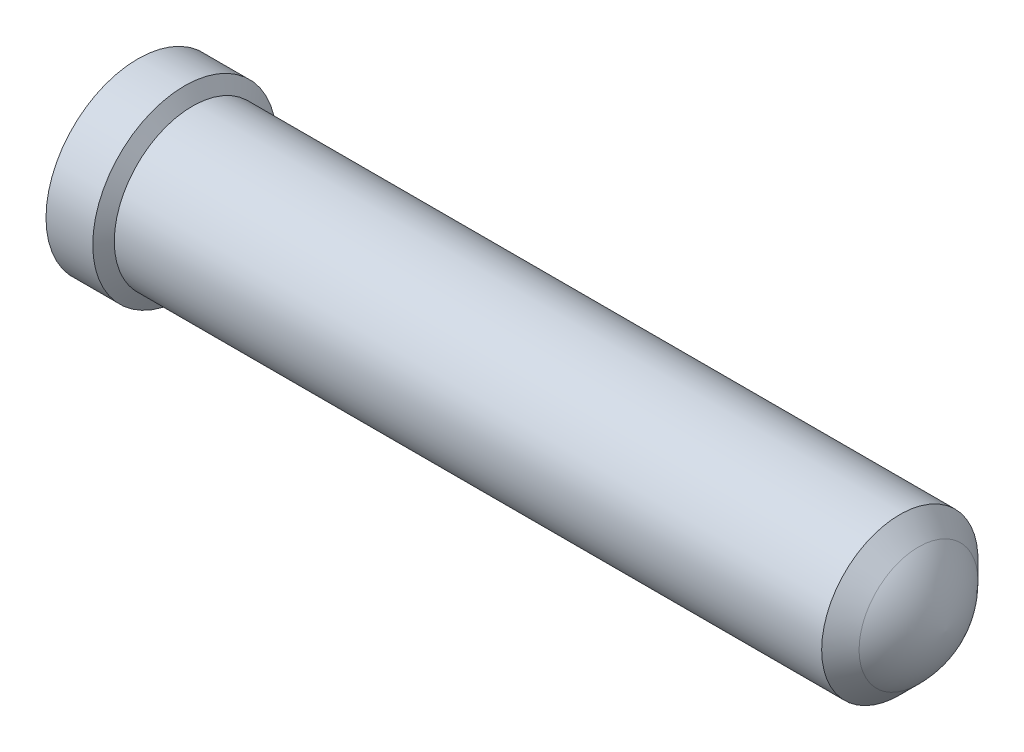
ISO-10303-21;
HEADER;
FILE_DESCRIPTION(('STEP AP214'),'2;1');
FILE_NAME('part.step','',(''),(''),'','','');
FILE_SCHEMA(('AUTOMOTIVE_DESIGN { 1 0 10303 214 1 1 1 1 }'));
ENDSEC;
DATA;
#1=APPLICATION_CONTEXT('core data for automotive mechanical design processes');
#2=APPLICATION_PROTOCOL_DEFINITION('international standard','automotive_design',2000,#1);
#3=PRODUCT_CONTEXT('',#1,'mechanical');
#4=PRODUCT('Part','Part','',(#3));
#5=PRODUCT_RELATED_PRODUCT_CATEGORY('part','',(#4));
#6=PRODUCT_DEFINITION_FORMATION('','',#4);
#7=PRODUCT_DEFINITION_CONTEXT('part definition',#1,'design');
#8=PRODUCT_DEFINITION('design','',#6,#7);
#9=PRODUCT_DEFINITION_SHAPE('','',#8);
#10=(LENGTH_UNIT() NAMED_UNIT(*) SI_UNIT(.MILLI.,.METRE.));
#11=(NAMED_UNIT(*) PLANE_ANGLE_UNIT() SI_UNIT($,.RADIAN.));
#12=(NAMED_UNIT(*) SI_UNIT($,.STERADIAN.) SOLID_ANGLE_UNIT());
#13=UNCERTAINTY_MEASURE_WITH_UNIT(LENGTH_MEASURE(1.E-05),#10,'distance_accuracy_value','');
#14=(GEOMETRIC_REPRESENTATION_CONTEXT(3) GLOBAL_UNCERTAINTY_ASSIGNED_CONTEXT((#13)) GLOBAL_UNIT_ASSIGNED_CONTEXT((#10,
#11,#12)) REPRESENTATION_CONTEXT('',''));
#15=CARTESIAN_POINT('',(0.,0.,0.));
#16=DIRECTION('',(0.,0.,1.));
#17=DIRECTION('',(1.,0.,0.));
#18=AXIS2_PLACEMENT_3D('',#15,#16,#17);
#19=CARTESIAN_POINT('',(0.,0.,0.));
#20=DIRECTION('',(-1.,0.,0.));
#21=DIRECTION('',(0.,0.,1.));
#22=AXIS2_PLACEMENT_3D('',#19,#20,#21);
#23=CONICAL_SURFACE('',#22,0.5461,0.785398163397);
#24=CARTESIAN_POINT('',(0.,0.,0.));
#25=DIRECTION('',(-1.,0.,0.));
#26=DIRECTION('',(0.,0.,1.));
#27=AXIS2_PLACEMENT_3D('',#24,#25,#26);
#28=CIRCLE('',#27,0.5461);
#29=CARTESIAN_POINT('',(0.,0.,0.5461));
#30=VERTEX_POINT('',#29);
#31=EDGE_CURVE('E11',#30,#30,#28,.T.);
#32=ORIENTED_EDGE('',*,*,#31,.T.);
#33=EDGE_LOOP('',(#32));
#34=FACE_BOUND('',#33,.T.);
#35=CARTESIAN_POINT('',(0.0889,0.,0.));
#36=DIRECTION('',(-1.,0.,0.));
#37=DIRECTION('',(0.,0.,1.));
#38=AXIS2_PLACEMENT_3D('',#35,#36,#37);
#39=CIRCLE('',#38,0.4572);
#40=CARTESIAN_POINT('',(0.0889,0.,0.4572));
#41=VERTEX_POINT('',#40);
#42=EDGE_CURVE('E29',#41,#41,#39,.T.);
#43=ORIENTED_EDGE('',*,*,#42,.F.);
#44=EDGE_LOOP('',(#43));
#45=FACE_BOUND('',#44,.T.);
#46=ADVANCED_FACE('F17',(#34,#45),#23,.F.);
#47=CARTESIAN_POINT('',(0.,0.,0.));
#48=DIRECTION('',(-1.,0.,0.));
#49=DIRECTION('',(0.,0.,1.));
#50=AXIS2_PLACEMENT_3D('',#47,#48,#49);
#51=CYLINDRICAL_SURFACE('',#50,0.4572);
#52=ORIENTED_EDGE('',*,*,#42,.T.);
#53=EDGE_LOOP('',(#52));
#54=FACE_BOUND('',#53,.T.);
#55=CARTESIAN_POINT('',(1.9304,0.,0.));
#56=DIRECTION('',(-1.,0.,0.));
#57=DIRECTION('',(0.,0.,1.));
#58=AXIS2_PLACEMENT_3D('',#55,#56,#57);
#59=CIRCLE('',#58,0.4572);
#60=CARTESIAN_POINT('',(1.9304,0.,0.4572));
#61=VERTEX_POINT('',#60);
#62=EDGE_CURVE('E94',#61,#61,#59,.T.);
#63=ORIENTED_EDGE('',*,*,#62,.F.);
#64=EDGE_LOOP('',(#63));
#65=FACE_BOUND('',#64,.T.);
#66=ADVANCED_FACE('F46',(#54,#65),#51,.F.);
#67=CARTESIAN_POINT('',(1.9304,0.,0.));
#68=DIRECTION('',(-1.,0.,0.));
#69=DIRECTION('',(0.,0.,1.));
#70=AXIS2_PLACEMENT_3D('',#67,#68,#69);
#71=CONICAL_SURFACE('',#70,0.4572,1.029744258677);
#72=ORIENTED_EDGE('',*,*,#62,.T.);
#73=EDGE_LOOP('',(#72));
#74=FACE_BOUND('',#73,.T.);
#75=CARTESIAN_POINT('',(2.205113475019,0.,0.));
#76=VERTEX_POINT('',#75);
#77=VERTEX_LOOP('',#76);
#78=FACE_BOUND('',#77,.T.);
#79=ADVANCED_FACE('F52',(#74,#78),#71,.F.);
#80=CARTESIAN_POINT('',(0.,0.,0.));
#81=DIRECTION('',(1.,0.,0.));
#82=DIRECTION('',(0.,0.,-1.));
#83=AXIS2_PLACEMENT_3D('',#80,#81,#82);
#84=PLANE('',#83);
#85=ORIENTED_EDGE('',*,*,#31,.F.);
#86=EDGE_LOOP('',(#85));
#87=FACE_BOUND('',#86,.T.);
#88=CARTESIAN_POINT('',(0.,0.,0.));
#89=DIRECTION('',(-1.,0.,0.));
#90=DIRECTION('',(0.,0.,1.));
#91=AXIS2_PLACEMENT_3D('',#88,#89,#90);
#92=CIRCLE('',#91,0.62357);
#93=CARTESIAN_POINT('',(0.,0.,0.62357));
#94=VERTEX_POINT('',#93);
#95=EDGE_CURVE('E91',#94,#94,#92,.T.);
#96=ORIENTED_EDGE('',*,*,#95,.T.);
#97=EDGE_LOOP('',(#96));
#98=FACE_BOUND('',#97,.T.);
#99=ADVANCED_FACE('F59',(#87,#98),#84,.F.);
#100=CARTESIAN_POINT('',(0.,0.,0.));
#101=DIRECTION('',(-1.,0.,0.));
#102=DIRECTION('',(0.,0.,1.));
#103=AXIS2_PLACEMENT_3D('',#100,#101,#102);
#104=CYLINDRICAL_SURFACE('',#103,0.62357);
#105=ORIENTED_EDGE('',*,*,#95,.F.);
#106=EDGE_LOOP('',(#105));
#107=FACE_BOUND('',#106,.T.);
#108=CARTESIAN_POINT('',(0.3175,0.,0.));
#109=DIRECTION('',(-1.,0.,0.));
#110=DIRECTION('',(0.,0.,1.));
#111=AXIS2_PLACEMENT_3D('',#108,#109,#110);
#112=CIRCLE('',#111,0.62357);
#113=CARTESIAN_POINT('',(0.3175,0.,0.62357));
#114=VERTEX_POINT('',#113);
#115=EDGE_CURVE('E85',#114,#114,#112,.T.);
#116=ORIENTED_EDGE('',*,*,#115,.T.);
#117=EDGE_LOOP('',(#116));
#118=FACE_BOUND('',#117,.T.);
#119=ADVANCED_FACE('F63',(#107,#118),#104,.T.);
#120=CARTESIAN_POINT('',(0.371026143457,0.,0.));
#121=DIRECTION('',(-1.,0.,0.));
#122=DIRECTION('',(0.,0.,1.));
#123=AXIS2_PLACEMENT_3D('',#120,#121,#122);
#124=CONICAL_SURFACE('',#123,0.53086,1.047197551197);
#125=ORIENTED_EDGE('',*,*,#115,.F.);
#126=EDGE_LOOP('',(#125));
#127=FACE_BOUND('',#126,.T.);
#128=CARTESIAN_POINT('',(0.371026143457,0.,0.));
#129=DIRECTION('',(-1.,0.,0.));
#130=DIRECTION('',(0.,0.,1.));
#131=AXIS2_PLACEMENT_3D('',#128,#129,#130);
#132=CIRCLE('',#131,0.53086);
#133=CARTESIAN_POINT('',(0.371026143457,0.,0.53086));
#134=VERTEX_POINT('',#133);
#135=EDGE_CURVE('E79',#134,#134,#132,.T.);
#136=ORIENTED_EDGE('',*,*,#135,.T.);
#137=EDGE_LOOP('',(#136));
#138=FACE_BOUND('',#137,.T.);
#139=ADVANCED_FACE('F67',(#127,#138),#124,.T.);
#140=CARTESIAN_POINT('',(0.,0.,0.));
#141=DIRECTION('',(-1.,0.,0.));
#142=DIRECTION('',(0.,0.,1.));
#143=AXIS2_PLACEMENT_3D('',#140,#141,#142);
#144=CYLINDRICAL_SURFACE('',#143,0.53086);
#145=ORIENTED_EDGE('',*,*,#135,.F.);
#146=EDGE_LOOP('',(#145));
#147=FACE_BOUND('',#146,.T.);
#148=CARTESIAN_POINT('',(5.175020175764,0.,0.));
#149=DIRECTION('',(-1.,0.,0.));
#150=DIRECTION('',(0.,0.,1.));
#151=AXIS2_PLACEMENT_3D('',#148,#149,#150);
#152=CIRCLE('',#151,0.53086);
#153=CARTESIAN_POINT('',(5.175020175764,0.,0.53086));
#154=VERTEX_POINT('',#153);
#155=EDGE_CURVE('E82',#154,#154,#152,.T.);
#156=ORIENTED_EDGE('',*,*,#155,.T.);
#157=EDGE_LOOP('',(#156));
#158=FACE_BOUND('',#157,.T.);
#159=ADVANCED_FACE('F42',(#147,#158),#144,.T.);
#160=CARTESIAN_POINT('',(5.302020175764,0.,0.));
#161=DIRECTION('',(-1.,0.,0.));
#162=DIRECTION('',(0.,0.,1.));
#163=AXIS2_PLACEMENT_3D('',#160,#161,#162);
#164=CONICAL_SURFACE('',#163,0.40386,0.785398163397);
#165=ORIENTED_EDGE('',*,*,#155,.F.);
#166=EDGE_LOOP('',(#165));
#167=FACE_BOUND('',#166,.T.);
#168=CARTESIAN_POINT('',(5.302020175764,0.,0.));
#169=DIRECTION('',(-1.,0.,0.));
#170=DIRECTION('',(0.,0.,1.));
#171=AXIS2_PLACEMENT_3D('',#168,#169,#170);
#172=CIRCLE('',#171,0.40386);
#173=CARTESIAN_POINT('',(5.302020175764,0.,0.40386));
#174=VERTEX_POINT('',#173);
#175=EDGE_CURVE('E83',#174,#174,#172,.T.);
#176=ORIENTED_EDGE('',*,*,#175,.T.);
#177=EDGE_LOOP('',(#176));
#178=FACE_BOUND('',#177,.T.);
#179=ADVANCED_FACE('F36',(#167,#178),#164,.T.);
#180=CARTESIAN_POINT('',(5.302020175764,0.,-0.40386));
#181=CARTESIAN_POINT('',(5.366159977963,0.,-0.339720197801));
#182=CARTESIAN_POINT('',(5.418849472384,0.,-0.264128932894));
#183=CARTESIAN_POINT('',(5.457347117055,0.,-0.179804854373));
#184=CARTESIAN_POINT('',(5.479950090309,0.,-0.09047777139902));
#185=CARTESIAN_POINT('',(5.4864,0.,0.));
#186=B_SPLINE_CURVE_WITH_KNOTS('',5,(#180,#181,#182,#183,#184,#185),.UNSPECIFIED.,.F.,.F.,(6,6),
(3.926990816987,4.641222141068),.UNSPECIFIED.);
#187=CARTESIAN_POINT('',(4.85300736971,0.,0.));
#188=DIRECTION('',(1.,0.,0.));
#189=AXIS1_PLACEMENT('',#187,#188);
#190=SURFACE_OF_REVOLUTION('',#186,#189);
#191=ORIENTED_EDGE('',*,*,#175,.F.);
#192=EDGE_LOOP('',(#191));
#193=FACE_BOUND('',#192,.T.);
#194=CARTESIAN_POINT('',(5.4864,0.,0.));
#195=VERTEX_POINT('',#194);
#196=VERTEX_LOOP('',#195);
#197=FACE_BOUND('',#196,.T.);
#198=ADVANCED_FACE('F19',(#193,#197),#190,.T.);
#199=CLOSED_SHELL('',(#46,#66,#79,#99,#119,#139,#159,#179,#198));
#200=MANIFOLD_SOLID_BREP('B1',#199);
#201=ADVANCED_BREP_SHAPE_REPRESENTATION('',(#18,#200),#14);
#202=SHAPE_DEFINITION_REPRESENTATION(#9,#201);
ENDSEC;
END-ISO-10303-21;
